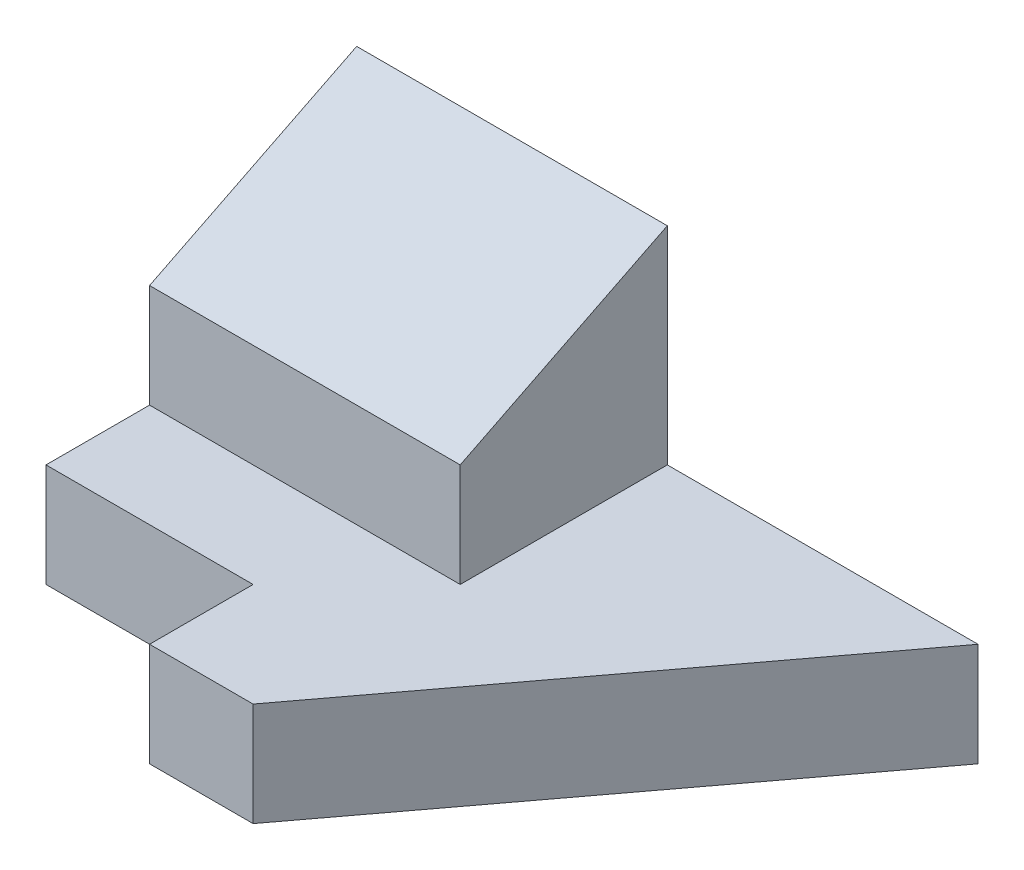
ISO-10303-21;
HEADER;
FILE_DESCRIPTION(('STEP AP214'),'2;1');
FILE_NAME('part.step','',(''),(''),'','','');
FILE_SCHEMA(('AUTOMOTIVE_DESIGN { 1 0 10303 214 1 1 1 1 }'));
ENDSEC;
DATA;
#1=APPLICATION_CONTEXT('core data for automotive mechanical design processes');
#2=APPLICATION_PROTOCOL_DEFINITION('international standard','automotive_design',2000,#1);
#3=PRODUCT_CONTEXT('',#1,'mechanical');
#4=PRODUCT('Part','Part','',(#3));
#5=PRODUCT_RELATED_PRODUCT_CATEGORY('part','',(#4));
#6=PRODUCT_DEFINITION_FORMATION('','',#4);
#7=PRODUCT_DEFINITION_CONTEXT('part definition',#1,'design');
#8=PRODUCT_DEFINITION('design','',#6,#7);
#9=PRODUCT_DEFINITION_SHAPE('','',#8);
#10=(LENGTH_UNIT() NAMED_UNIT(*) SI_UNIT(.MILLI.,.METRE.));
#11=(NAMED_UNIT(*) PLANE_ANGLE_UNIT() SI_UNIT($,.RADIAN.));
#12=(NAMED_UNIT(*) SI_UNIT($,.STERADIAN.) SOLID_ANGLE_UNIT());
#13=UNCERTAINTY_MEASURE_WITH_UNIT(LENGTH_MEASURE(1.E-05),#10,'distance_accuracy_value','');
#14=(GEOMETRIC_REPRESENTATION_CONTEXT(3) GLOBAL_UNCERTAINTY_ASSIGNED_CONTEXT((#13)) GLOBAL_UNIT_ASSIGNED_CONTEXT((#10,
#11,#12)) REPRESENTATION_CONTEXT('',''));
#15=CARTESIAN_POINT('',(0.,0.,0.));
#16=DIRECTION('',(0.,0.,1.));
#17=DIRECTION('',(1.,0.,0.));
#18=AXIS2_PLACEMENT_3D('',#15,#16,#17);
#19=CARTESIAN_POINT('',(0.,10.,0.));
#20=DIRECTION('',(1.,0.,0.));
#21=DIRECTION('',(0.,0.,-1.));
#22=AXIS2_PLACEMENT_3D('',#19,#20,#21);
#23=PLANE('',#22);
#24=DIRECTION('',(0.,0.,1.));
#25=VECTOR('',#24,1.);
#26=CARTESIAN_POINT('',(0.,0.,0.));
#27=LINE('',#26,#25);
#28=CARTESIAN_POINT('',(0.,0.,-30.));
#29=VERTEX_POINT('',#28);
#30=CARTESIAN_POINT('',(0.,0.,0.));
#31=VERTEX_POINT('',#30);
#32=EDGE_CURVE('E132',#29,#31,#27,.T.);
#33=ORIENTED_EDGE('',*,*,#32,.T.);
#34=DIRECTION('',(0.,-1.,0.));
#35=VECTOR('',#34,1.);
#36=CARTESIAN_POINT('',(0.,10.,0.));
#37=LINE('',#36,#35);
#38=CARTESIAN_POINT('',(0.,10.,0.));
#39=VERTEX_POINT('',#38);
#40=EDGE_CURVE('E11',#39,#31,#37,.T.);
#41=ORIENTED_EDGE('',*,*,#40,.F.);
#42=DIRECTION('',(0.,0.,1.));
#43=VECTOR('',#42,1.);
#44=CARTESIAN_POINT('',(0.,10.,0.));
#45=LINE('',#44,#43);
#46=CARTESIAN_POINT('',(0.,10.,-10.));
#47=VERTEX_POINT('',#46);
#48=EDGE_CURVE('E95',#47,#39,#45,.T.);
#49=ORIENTED_EDGE('',*,*,#48,.F.);
#50=DIRECTION('',(0.,1.,0.));
#51=VECTOR('',#50,1.);
#52=CARTESIAN_POINT('',(0.,10.,-10.));
#53=LINE('',#52,#51);
#54=CARTESIAN_POINT('',(0.,20.,-10.));
#55=VERTEX_POINT('',#54);
#56=EDGE_CURVE('E51',#47,#55,#53,.T.);
#57=ORIENTED_EDGE('',*,*,#56,.T.);
#58=DIRECTION('',(0.,-0.447213595499958,0.894427190999916));
#59=VECTOR('',#58,1.);
#60=CARTESIAN_POINT('',(0.,30.,-30.));
#61=LINE('',#60,#59);
#62=CARTESIAN_POINT('',(0.,30.,-30.));
#63=VERTEX_POINT('',#62);
#64=EDGE_CURVE('E186',#63,#55,#61,.T.);
#65=ORIENTED_EDGE('',*,*,#64,.F.);
#66=DIRECTION('',(0.,-1.,0.));
#67=VECTOR('',#66,1.);
#68=CARTESIAN_POINT('',(0.,10.,-30.));
#69=LINE('',#68,#67);
#70=EDGE_CURVE('E131',#63,#29,#69,.T.);
#71=ORIENTED_EDGE('',*,*,#70,.T.);
#72=EDGE_LOOP('',(#33,#41,#49,#57,#65,#71));
#73=FACE_BOUND('',#72,.T.);
#74=ADVANCED_FACE('F37',(#73),#23,.F.);
#75=CARTESIAN_POINT('',(0.,10.,0.));
#76=DIRECTION('',(0.,0.,-1.));
#77=DIRECTION('',(-1.,0.,0.));
#78=AXIS2_PLACEMENT_3D('',#75,#76,#77);
#79=PLANE('',#78);
#80=DIRECTION('',(1.,0.,0.));
#81=VECTOR('',#80,1.);
#82=CARTESIAN_POINT('',(0.,0.,0.));
#83=LINE('',#82,#81);
#84=CARTESIAN_POINT('',(20.,0.,0.));
#85=VERTEX_POINT('',#84);
#86=EDGE_CURVE('E135',#31,#85,#83,.T.);
#87=ORIENTED_EDGE('',*,*,#86,.T.);
#88=DIRECTION('',(0.,-1.,0.));
#89=VECTOR('',#88,1.);
#90=CARTESIAN_POINT('',(20.,10.,0.));
#91=LINE('',#90,#89);
#92=CARTESIAN_POINT('',(20.,10.,0.));
#93=VERTEX_POINT('',#92);
#94=EDGE_CURVE('E44',#93,#85,#91,.T.);
#95=ORIENTED_EDGE('',*,*,#94,.F.);
#96=DIRECTION('',(1.,0.,0.));
#97=VECTOR('',#96,1.);
#98=CARTESIAN_POINT('',(0.,10.,0.));
#99=LINE('',#98,#97);
#100=EDGE_CURVE('E109',#39,#93,#99,.T.);
#101=ORIENTED_EDGE('',*,*,#100,.F.);
#102=ORIENTED_EDGE('',*,*,#40,.T.);
#103=EDGE_LOOP('',(#87,#95,#101,#102));
#104=FACE_BOUND('',#103,.T.);
#105=ADVANCED_FACE('F201',(#104),#79,.F.);
#106=CARTESIAN_POINT('',(20.,10.,0.));
#107=DIRECTION('',(1.,0.,0.));
#108=DIRECTION('',(0.,0.,-1.));
#109=AXIS2_PLACEMENT_3D('',#106,#107,#108);
#110=PLANE('',#109);
#111=DIRECTION('',(0.,0.,1.));
#112=VECTOR('',#111,1.);
#113=CARTESIAN_POINT('',(20.,0.,0.));
#114=LINE('',#113,#112);
#115=CARTESIAN_POINT('',(20.,0.,10.));
#116=VERTEX_POINT('',#115);
#117=EDGE_CURVE('E118',#85,#116,#114,.T.);
#118=ORIENTED_EDGE('',*,*,#117,.T.);
#119=DIRECTION('',(0.,-1.,0.));
#120=VECTOR('',#119,1.);
#121=CARTESIAN_POINT('',(20.,10.,10.));
#122=LINE('',#121,#120);
#123=CARTESIAN_POINT('',(20.,10.,10.));
#124=VERTEX_POINT('',#123);
#125=EDGE_CURVE('E115',#124,#116,#122,.T.);
#126=ORIENTED_EDGE('',*,*,#125,.F.);
#127=DIRECTION('',(0.,0.,1.));
#128=VECTOR('',#127,1.);
#129=CARTESIAN_POINT('',(20.,10.,0.));
#130=LINE('',#129,#128);
#131=EDGE_CURVE('E103',#93,#124,#130,.T.);
#132=ORIENTED_EDGE('',*,*,#131,.F.);
#133=ORIENTED_EDGE('',*,*,#94,.T.);
#134=EDGE_LOOP('',(#118,#126,#132,#133));
#135=FACE_BOUND('',#134,.T.);
#136=ADVANCED_FACE('F116',(#135),#110,.F.);
#137=CARTESIAN_POINT('',(20.,10.,10.));
#138=DIRECTION('',(0.,0.,-1.));
#139=DIRECTION('',(-1.,0.,0.));
#140=AXIS2_PLACEMENT_3D('',#137,#138,#139);
#141=PLANE('',#140);
#142=DIRECTION('',(1.,0.,0.));
#143=VECTOR('',#142,1.);
#144=CARTESIAN_POINT('',(20.,0.,10.));
#145=LINE('',#144,#143);
#146=CARTESIAN_POINT('',(30.,0.,10.));
#147=VERTEX_POINT('',#146);
#148=EDGE_CURVE('E139',#116,#147,#145,.T.);
#149=ORIENTED_EDGE('',*,*,#148,.T.);
#150=DIRECTION('',(0.,-1.,0.));
#151=VECTOR('',#150,1.);
#152=CARTESIAN_POINT('',(30.,10.,10.));
#153=LINE('',#152,#151);
#154=CARTESIAN_POINT('',(30.,10.,10.));
#155=VERTEX_POINT('',#154);
#156=EDGE_CURVE('E121',#155,#147,#153,.T.);
#157=ORIENTED_EDGE('',*,*,#156,.F.);
#158=DIRECTION('',(1.,0.,0.));
#159=VECTOR('',#158,1.);
#160=CARTESIAN_POINT('',(20.,10.,10.));
#161=LINE('',#160,#159);
#162=EDGE_CURVE('E107',#124,#155,#161,.T.);
#163=ORIENTED_EDGE('',*,*,#162,.F.);
#164=ORIENTED_EDGE('',*,*,#125,.T.);
#165=EDGE_LOOP('',(#149,#157,#163,#164));
#166=FACE_BOUND('',#165,.T.);
#167=ADVANCED_FACE('F123',(#166),#141,.F.);
#168=CARTESIAN_POINT('',(30.,10.,10.));
#169=DIRECTION('',(-0.8,0.,-0.6));
#170=DIRECTION('',(-0.6,0.,0.8));
#171=AXIS2_PLACEMENT_3D('',#168,#169,#170);
#172=PLANE('',#171);
#173=DIRECTION('',(0.6,0.,-0.8));
#174=VECTOR('',#173,1.);
#175=CARTESIAN_POINT('',(30.,0.,10.));
#176=LINE('',#175,#174);
#177=CARTESIAN_POINT('',(60.,0.,-30.));
#178=VERTEX_POINT('',#177);
#179=EDGE_CURVE('E141',#147,#178,#176,.T.);
#180=ORIENTED_EDGE('',*,*,#179,.T.);
#181=DIRECTION('',(0.,-1.,0.));
#182=VECTOR('',#181,1.);
#183=CARTESIAN_POINT('',(60.,10.,-30.));
#184=LINE('',#183,#182);
#185=CARTESIAN_POINT('',(60.,10.,-30.));
#186=VERTEX_POINT('',#185);
#187=EDGE_CURVE('E145',#186,#178,#184,.T.);
#188=ORIENTED_EDGE('',*,*,#187,.F.);
#189=DIRECTION('',(0.6,0.,-0.8));
#190=VECTOR('',#189,1.);
#191=CARTESIAN_POINT('',(30.,10.,10.));
#192=LINE('',#191,#190);
#193=EDGE_CURVE('E60',#155,#186,#192,.T.);
#194=ORIENTED_EDGE('',*,*,#193,.F.);
#195=ORIENTED_EDGE('',*,*,#156,.T.);
#196=EDGE_LOOP('',(#180,#188,#194,#195));
#197=FACE_BOUND('',#196,.T.);
#198=ADVANCED_FACE('F153',(#197),#172,.F.);
#199=CARTESIAN_POINT('',(0.,10.,-30.));
#200=DIRECTION('',(0.,0.,1.));
#201=DIRECTION('',(1.,0.,0.));
#202=AXIS2_PLACEMENT_3D('',#199,#200,#201);
#203=PLANE('',#202);
#204=DIRECTION('',(-1.,0.,0.));
#205=VECTOR('',#204,1.);
#206=CARTESIAN_POINT('',(0.,0.,-30.));
#207=LINE('',#206,#205);
#208=EDGE_CURVE('E88',#178,#29,#207,.T.);
#209=ORIENTED_EDGE('',*,*,#208,.T.);
#210=ORIENTED_EDGE('',*,*,#70,.F.);
#211=DIRECTION('',(-1.,0.,0.));
#212=VECTOR('',#211,1.);
#213=CARTESIAN_POINT('',(30.,30.,-30.));
#214=LINE('',#213,#212);
#215=CARTESIAN_POINT('',(30.,30.,-30.));
#216=VERTEX_POINT('',#215);
#217=EDGE_CURVE('E185',#216,#63,#214,.T.);
#218=ORIENTED_EDGE('',*,*,#217,.F.);
#219=DIRECTION('',(0.,-1.,0.));
#220=VECTOR('',#219,1.);
#221=CARTESIAN_POINT('',(30.,10.,-30.));
#222=LINE('',#221,#220);
#223=CARTESIAN_POINT('',(30.,10.,-30.));
#224=VERTEX_POINT('',#223);
#225=EDGE_CURVE('E160',#216,#224,#222,.T.);
#226=ORIENTED_EDGE('',*,*,#225,.T.);
#227=DIRECTION('',(-1.,0.,0.));
#228=VECTOR('',#227,1.);
#229=CARTESIAN_POINT('',(0.,10.,-30.));
#230=LINE('',#229,#228);
#231=EDGE_CURVE('E126',#186,#224,#230,.T.);
#232=ORIENTED_EDGE('',*,*,#231,.F.);
#233=ORIENTED_EDGE('',*,*,#187,.T.);
#234=EDGE_LOOP('',(#209,#210,#218,#226,#232,#233));
#235=FACE_BOUND('',#234,.T.);
#236=ADVANCED_FACE('F156',(#235),#203,.F.);
#237=CARTESIAN_POINT('',(0.,10.,0.));
#238=DIRECTION('',(0.,-1.,0.));
#239=DIRECTION('',(0.,0.,-1.));
#240=AXIS2_PLACEMENT_3D('',#237,#238,#239);
#241=PLANE('',#240);
#242=ORIENTED_EDGE('',*,*,#231,.T.);
#243=DIRECTION('',(0.,0.,1.));
#244=VECTOR('',#243,1.);
#245=CARTESIAN_POINT('',(30.,10.,-30.));
#246=LINE('',#245,#244);
#247=CARTESIAN_POINT('',(30.,10.,-10.));
#248=VERTEX_POINT('',#247);
#249=EDGE_CURVE('E164',#224,#248,#246,.T.);
#250=ORIENTED_EDGE('',*,*,#249,.T.);
#251=DIRECTION('',(-1.,0.,0.));
#252=VECTOR('',#251,1.);
#253=CARTESIAN_POINT('',(30.,10.,-10.));
#254=LINE('',#253,#252);
#255=EDGE_CURVE('E178',#248,#47,#254,.T.);
#256=ORIENTED_EDGE('',*,*,#255,.T.);
#257=ORIENTED_EDGE('',*,*,#48,.T.);
#258=ORIENTED_EDGE('',*,*,#100,.T.);
#259=ORIENTED_EDGE('',*,*,#131,.T.);
#260=ORIENTED_EDGE('',*,*,#162,.T.);
#261=ORIENTED_EDGE('',*,*,#193,.T.);
#262=EDGE_LOOP('',(#242,#250,#256,#257,#258,#259,#260,#261));
#263=FACE_BOUND('',#262,.T.);
#264=ADVANCED_FACE('F105',(#263),#241,.F.);
#265=CARTESIAN_POINT('',(0.,0.,0.));
#266=DIRECTION('',(0.,-1.,0.));
#267=DIRECTION('',(0.,0.,-1.));
#268=AXIS2_PLACEMENT_3D('',#265,#266,#267);
#269=PLANE('',#268);
#270=ORIENTED_EDGE('',*,*,#32,.F.);
#271=ORIENTED_EDGE('',*,*,#208,.F.);
#272=ORIENTED_EDGE('',*,*,#179,.F.);
#273=ORIENTED_EDGE('',*,*,#148,.F.);
#274=ORIENTED_EDGE('',*,*,#117,.F.);
#275=ORIENTED_EDGE('',*,*,#86,.F.);
#276=EDGE_LOOP('',(#270,#271,#272,#273,#274,#275));
#277=FACE_BOUND('',#276,.T.);
#278=ADVANCED_FACE('F150',(#277),#269,.T.);
#279=CARTESIAN_POINT('',(30.,10.,-10.));
#280=DIRECTION('',(0.,0.,1.));
#281=DIRECTION('',(1.,0.,0.));
#282=AXIS2_PLACEMENT_3D('',#279,#280,#281);
#283=PLANE('',#282);
#284=ORIENTED_EDGE('',*,*,#56,.F.);
#285=ORIENTED_EDGE('',*,*,#255,.F.);
#286=DIRECTION('',(0.,1.,0.));
#287=VECTOR('',#286,1.);
#288=CARTESIAN_POINT('',(30.,10.,-10.));
#289=LINE('',#288,#287);
#290=CARTESIAN_POINT('',(30.,20.,-10.));
#291=VERTEX_POINT('',#290);
#292=EDGE_CURVE('E174',#248,#291,#289,.T.);
#293=ORIENTED_EDGE('',*,*,#292,.T.);
#294=DIRECTION('',(-1.,0.,0.));
#295=VECTOR('',#294,1.);
#296=CARTESIAN_POINT('',(30.,20.,-10.));
#297=LINE('',#296,#295);
#298=EDGE_CURVE('E136',#291,#55,#297,.T.);
#299=ORIENTED_EDGE('',*,*,#298,.T.);
#300=EDGE_LOOP('',(#284,#285,#293,#299));
#301=FACE_BOUND('',#300,.T.);
#302=ADVANCED_FACE('F176',(#301),#283,.T.);
#303=CARTESIAN_POINT('',(30.,0.,0.));
#304=DIRECTION('',(1.,0.,0.));
#305=DIRECTION('',(0.,0.,-1.));
#306=AXIS2_PLACEMENT_3D('',#303,#304,#305);
#307=PLANE('',#306);
#308=ORIENTED_EDGE('',*,*,#225,.F.);
#309=DIRECTION('',(0.,-0.447213595499958,0.894427190999916));
#310=VECTOR('',#309,1.);
#311=CARTESIAN_POINT('',(30.,30.,-30.));
#312=LINE('',#311,#310);
#313=EDGE_CURVE('E181',#216,#291,#312,.T.);
#314=ORIENTED_EDGE('',*,*,#313,.T.);
#315=ORIENTED_EDGE('',*,*,#292,.F.);
#316=ORIENTED_EDGE('',*,*,#249,.F.);
#317=EDGE_LOOP('',(#308,#314,#315,#316));
#318=FACE_BOUND('',#317,.T.);
#319=ADVANCED_FACE('F182',(#318),#307,.T.);
#320=CARTESIAN_POINT('',(30.,30.,-30.));
#321=DIRECTION('',(0.,-0.894427190999916,-0.447213595499958));
#322=DIRECTION('',(0.,0.447213595499958,-0.894427190999916));
#323=AXIS2_PLACEMENT_3D('',#320,#321,#322);
#324=PLANE('',#323);
#325=ORIENTED_EDGE('',*,*,#64,.T.);
#326=ORIENTED_EDGE('',*,*,#298,.F.);
#327=ORIENTED_EDGE('',*,*,#313,.F.);
#328=ORIENTED_EDGE('',*,*,#217,.T.);
#329=EDGE_LOOP('',(#325,#326,#327,#328));
#330=FACE_BOUND('',#329,.T.);
#331=ADVANCED_FACE('F189',(#330),#324,.F.);
#332=CLOSED_SHELL('',(#74,#105,#136,#167,#198,#236,#264,#278,#302,#319,#331));
#333=MANIFOLD_SOLID_BREP('B2',#332);
#334=ADVANCED_BREP_SHAPE_REPRESENTATION('',(#18,#333),#14);
#335=SHAPE_DEFINITION_REPRESENTATION(#9,#334);
ENDSEC;
END-ISO-10303-21;
